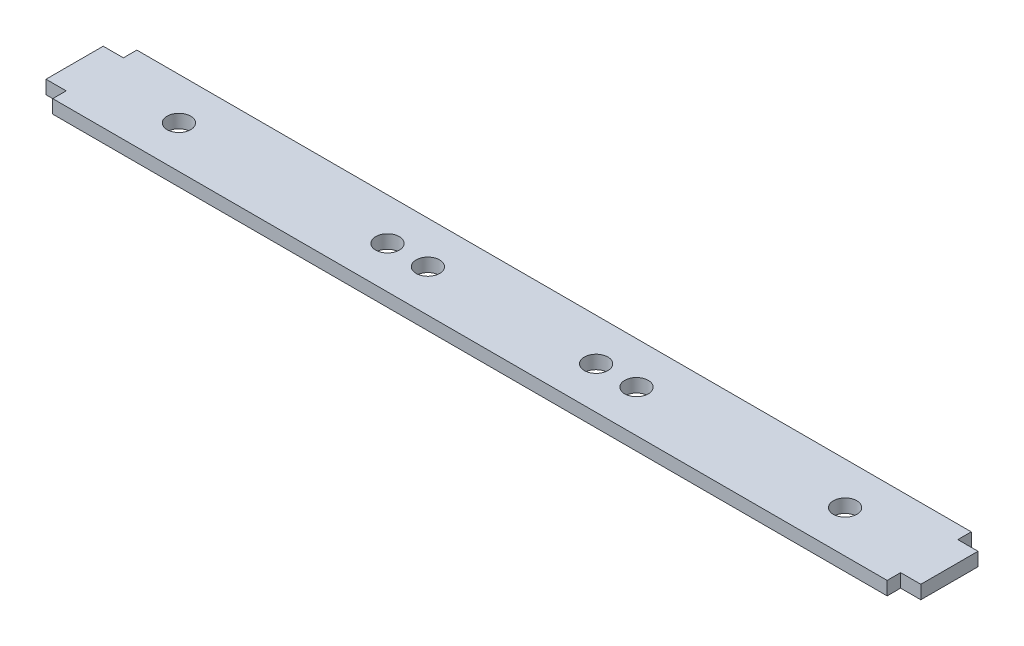
ISO-10303-21;
HEADER;
FILE_DESCRIPTION(('STEP AP214'),'2;1');
FILE_NAME('part.step','',(''),(''),'','','');
FILE_SCHEMA(('AUTOMOTIVE_DESIGN { 1 0 10303 214 1 1 1 1 }'));
ENDSEC;
DATA;
#1=APPLICATION_CONTEXT('core data for automotive mechanical design processes');
#2=APPLICATION_PROTOCOL_DEFINITION('international standard','automotive_design',2000,#1);
#3=PRODUCT_CONTEXT('',#1,'mechanical');
#4=PRODUCT('Part','Part','',(#3));
#5=PRODUCT_RELATED_PRODUCT_CATEGORY('part','',(#4));
#6=PRODUCT_DEFINITION_FORMATION('','',#4);
#7=PRODUCT_DEFINITION_CONTEXT('part definition',#1,'design');
#8=PRODUCT_DEFINITION('design','',#6,#7);
#9=PRODUCT_DEFINITION_SHAPE('','',#8);
#10=(LENGTH_UNIT() NAMED_UNIT(*) SI_UNIT(.MILLI.,.METRE.));
#11=(NAMED_UNIT(*) PLANE_ANGLE_UNIT() SI_UNIT($,.RADIAN.));
#12=(NAMED_UNIT(*) SI_UNIT($,.STERADIAN.) SOLID_ANGLE_UNIT());
#13=UNCERTAINTY_MEASURE_WITH_UNIT(LENGTH_MEASURE(1.E-05),#10,'distance_accuracy_value','');
#14=(GEOMETRIC_REPRESENTATION_CONTEXT(3) GLOBAL_UNCERTAINTY_ASSIGNED_CONTEXT((#13)) GLOBAL_UNIT_ASSIGNED_CONTEXT((#10,
#11,#12)) REPRESENTATION_CONTEXT('',''));
#15=CARTESIAN_POINT('',(0.,0.,0.));
#16=DIRECTION('',(0.,0.,1.));
#17=DIRECTION('',(1.,0.,0.));
#18=AXIS2_PLACEMENT_3D('',#15,#16,#17);
#19=CARTESIAN_POINT('',(0.,-1.,0.));
#20=DIRECTION('',(0.,1.,0.));
#21=DIRECTION('',(0.,0.,1.));
#22=AXIS2_PLACEMENT_3D('',#19,#20,#21);
#23=PLANE('',#22);
#24=CARTESIAN_POINT('',(-18.5,-1.,0.));
#25=DIRECTION('',(0.,-1.,0.));
#26=DIRECTION('',(0.,0.,-1.));
#27=AXIS2_PLACEMENT_3D('',#24,#25,#26);
#28=CIRCLE('',#27,1.75);
#29=CARTESIAN_POINT('',(-18.5,-1.,-1.75));
#30=VERTEX_POINT('',#29);
#31=EDGE_CURVE('E146',#30,#30,#28,.F.);
#32=ORIENTED_EDGE('',*,*,#31,.T.);
#33=EDGE_LOOP('',(#32));
#34=FACE_BOUND('',#33,.T.);
#35=CARTESIAN_POINT('',(18.5,-1.,0.));
#36=DIRECTION('',(0.,-1.,0.));
#37=DIRECTION('',(0.,0.,-1.));
#38=AXIS2_PLACEMENT_3D('',#35,#36,#37);
#39=CIRCLE('',#38,1.75);
#40=CARTESIAN_POINT('',(18.5,-1.,-1.75));
#41=VERTEX_POINT('',#40);
#42=EDGE_CURVE('E150',#41,#41,#39,.F.);
#43=ORIENTED_EDGE('',*,*,#42,.T.);
#44=EDGE_LOOP('',(#43));
#45=FACE_BOUND('',#44,.T.);
#46=CARTESIAN_POINT('',(-49.5,-1.,0.));
#47=DIRECTION('',(0.,-1.,0.));
#48=DIRECTION('',(0.,0.,-1.));
#49=AXIS2_PLACEMENT_3D('',#46,#47,#48);
#50=CIRCLE('',#49,1.75);
#51=CARTESIAN_POINT('',(-49.5,-1.,-1.75000000000001));
#52=VERTEX_POINT('',#51);
#53=EDGE_CURVE('E153',#52,#52,#50,.F.);
#54=ORIENTED_EDGE('',*,*,#53,.T.);
#55=EDGE_LOOP('',(#54));
#56=FACE_BOUND('',#55,.T.);
#57=CARTESIAN_POINT('',(49.5,-1.,0.));
#58=DIRECTION('',(0.,-1.,0.));
#59=DIRECTION('',(0.,0.,-1.));
#60=AXIS2_PLACEMENT_3D('',#57,#58,#59);
#61=CIRCLE('',#60,1.75);
#62=CARTESIAN_POINT('',(49.5,-1.,-1.75000000000001));
#63=VERTEX_POINT('',#62);
#64=EDGE_CURVE('E156',#63,#63,#61,.F.);
#65=ORIENTED_EDGE('',*,*,#64,.T.);
#66=EDGE_LOOP('',(#65));
#67=FACE_BOUND('',#66,.T.);
#68=CARTESIAN_POINT('',(12.5,-1.,0.));
#69=DIRECTION('',(0.,-1.,0.));
#70=DIRECTION('',(0.,0.,-1.));
#71=AXIS2_PLACEMENT_3D('',#68,#69,#70);
#72=CIRCLE('',#71,1.75);
#73=CARTESIAN_POINT('',(12.5,-1.,-1.75));
#74=VERTEX_POINT('',#73);
#75=EDGE_CURVE('E158',#74,#74,#72,.F.);
#76=ORIENTED_EDGE('',*,*,#75,.T.);
#77=EDGE_LOOP('',(#76));
#78=FACE_BOUND('',#77,.T.);
#79=CARTESIAN_POINT('',(-12.5,-1.,0.));
#80=DIRECTION('',(0.,-1.,0.));
#81=DIRECTION('',(0.,0.,-1.));
#82=AXIS2_PLACEMENT_3D('',#79,#80,#81);
#83=CIRCLE('',#82,1.75);
#84=CARTESIAN_POINT('',(-12.5,-1.,-1.75));
#85=VERTEX_POINT('',#84);
#86=EDGE_CURVE('E20',#85,#85,#83,.F.);
#87=ORIENTED_EDGE('',*,*,#86,.T.);
#88=EDGE_LOOP('',(#87));
#89=FACE_BOUND('',#88,.T.);
#90=DIRECTION('',(-1.,0.,0.));
#91=VECTOR('',#90,1.);
#92=CARTESIAN_POINT('',(0.,-1.,4.24999999999998));
#93=LINE('',#92,#91);
#94=CARTESIAN_POINT('',(65.,-1.,4.25));
#95=VERTEX_POINT('',#94);
#96=CARTESIAN_POINT('',(62.,-1.,4.25));
#97=VERTEX_POINT('',#96);
#98=EDGE_CURVE('E163',#95,#97,#93,.T.);
#99=ORIENTED_EDGE('',*,*,#98,.T.);
#100=DIRECTION('',(0.,0.,-1.));
#101=VECTOR('',#100,1.);
#102=CARTESIAN_POINT('',(62.,-1.,0.));
#103=LINE('',#102,#101);
#104=CARTESIAN_POINT('',(62.,-1.,6.25000000000001));
#105=VERTEX_POINT('',#104);
#106=EDGE_CURVE('E175',#105,#97,#103,.T.);
#107=ORIENTED_EDGE('',*,*,#106,.F.);
#108=DIRECTION('',(-1.,0.,0.));
#109=VECTOR('',#108,1.);
#110=CARTESIAN_POINT('',(0.,-1.,6.25000000000001));
#111=LINE('',#110,#109);
#112=CARTESIAN_POINT('',(-62.,-1.,6.25000000000002));
#113=VERTEX_POINT('',#112);
#114=EDGE_CURVE('E177',#105,#113,#111,.T.);
#115=ORIENTED_EDGE('',*,*,#114,.T.);
#116=DIRECTION('',(0.,0.,-1.));
#117=VECTOR('',#116,1.);
#118=CARTESIAN_POINT('',(-62.,-1.,0.));
#119=LINE('',#118,#117);
#120=CARTESIAN_POINT('',(-62.,-1.,4.25000000000001));
#121=VERTEX_POINT('',#120);
#122=EDGE_CURVE('E182',#113,#121,#119,.T.);
#123=ORIENTED_EDGE('',*,*,#122,.T.);
#124=DIRECTION('',(1.,0.,0.));
#125=VECTOR('',#124,1.);
#126=CARTESIAN_POINT('',(0.,-1.,4.25000000000014));
#127=LINE('',#126,#125);
#128=CARTESIAN_POINT('',(-65.,-1.,4.25000000000001));
#129=VERTEX_POINT('',#128);
#130=EDGE_CURVE('E190',#129,#121,#127,.T.);
#131=ORIENTED_EDGE('',*,*,#130,.F.);
#132=DIRECTION('',(0.,0.,-1.));
#133=VECTOR('',#132,1.);
#134=CARTESIAN_POINT('',(-65.,-1.,0.));
#135=LINE('',#134,#133);
#136=CARTESIAN_POINT('',(-65.,-1.,-4.25000000000001));
#137=VERTEX_POINT('',#136);
#138=EDGE_CURVE('E192',#129,#137,#135,.T.);
#139=ORIENTED_EDGE('',*,*,#138,.T.);
#140=DIRECTION('',(1.,0.,0.));
#141=VECTOR('',#140,1.);
#142=CARTESIAN_POINT('',(0.,-1.,-4.25000000000014));
#143=LINE('',#142,#141);
#144=CARTESIAN_POINT('',(-62.,-1.,-4.25000000000002));
#145=VERTEX_POINT('',#144);
#146=EDGE_CURVE('E197',#137,#145,#143,.T.);
#147=ORIENTED_EDGE('',*,*,#146,.T.);
#148=DIRECTION('',(0.,0.,-1.));
#149=VECTOR('',#148,1.);
#150=CARTESIAN_POINT('',(-62.,-1.,0.));
#151=LINE('',#150,#149);
#152=CARTESIAN_POINT('',(-62.,-1.,-6.24999999999998));
#153=VERTEX_POINT('',#152);
#154=EDGE_CURVE('E202',#145,#153,#151,.T.);
#155=ORIENTED_EDGE('',*,*,#154,.T.);
#156=DIRECTION('',(-1.,0.,0.));
#157=VECTOR('',#156,1.);
#158=CARTESIAN_POINT('',(0.,-1.,-6.24999999999999));
#159=LINE('',#158,#157);
#160=CARTESIAN_POINT('',(62.,-1.,-6.25));
#161=VERTEX_POINT('',#160);
#162=EDGE_CURVE('E210',#161,#153,#159,.T.);
#163=ORIENTED_EDGE('',*,*,#162,.F.);
#164=DIRECTION('',(0.,0.,-1.));
#165=VECTOR('',#164,1.);
#166=CARTESIAN_POINT('',(62.,-1.,0.));
#167=LINE('',#166,#165);
#168=CARTESIAN_POINT('',(62.,-1.,-4.25));
#169=VERTEX_POINT('',#168);
#170=EDGE_CURVE('E103',#169,#161,#167,.T.);
#171=ORIENTED_EDGE('',*,*,#170,.F.);
#172=DIRECTION('',(-1.,0.,0.));
#173=VECTOR('',#172,1.);
#174=CARTESIAN_POINT('',(0.,-1.,-4.24999999999998));
#175=LINE('',#174,#173);
#176=CARTESIAN_POINT('',(65.,-1.,-4.25));
#177=VERTEX_POINT('',#176);
#178=EDGE_CURVE('E105',#177,#169,#175,.T.);
#179=ORIENTED_EDGE('',*,*,#178,.F.);
#180=DIRECTION('',(0.,0.,-1.));
#181=VECTOR('',#180,1.);
#182=CARTESIAN_POINT('',(65.,-1.,0.));
#183=LINE('',#182,#181);
#184=EDGE_CURVE('E108',#95,#177,#183,.T.);
#185=ORIENTED_EDGE('',*,*,#184,.F.);
#186=EDGE_LOOP('',(#99,#107,#115,#123,#131,#139,#147,#155,#163,#171,#179,#185));
#187=FACE_BOUND('',#186,.T.);
#188=ADVANCED_FACE('F17',(#34,#45,#56,#67,#78,#89,#187),#23,.F.);
#189=CARTESIAN_POINT('',(65.,1.,0.));
#190=DIRECTION('',(1.,0.,0.));
#191=DIRECTION('',(0.,0.,-1.));
#192=AXIS2_PLACEMENT_3D('',#189,#190,#191);
#193=PLANE('',#192);
#194=DIRECTION('',(0.,0.,1.));
#195=VECTOR('',#194,1.);
#196=CARTESIAN_POINT('',(65.,1.,0.));
#197=LINE('',#196,#195);
#198=CARTESIAN_POINT('',(65.,1.,4.25));
#199=VERTEX_POINT('',#198);
#200=CARTESIAN_POINT('',(65.,1.,-4.25));
#201=VERTEX_POINT('',#200);
#202=EDGE_CURVE('E149',#199,#201,#197,.F.);
#203=ORIENTED_EDGE('',*,*,#202,.F.);
#204=DIRECTION('',(0.,1.,0.));
#205=VECTOR('',#204,1.);
#206=CARTESIAN_POINT('',(65.,1.,4.25));
#207=LINE('',#206,#205);
#208=EDGE_CURVE('E119',#199,#95,#207,.F.);
#209=ORIENTED_EDGE('',*,*,#208,.T.);
#210=ORIENTED_EDGE('',*,*,#184,.T.);
#211=DIRECTION('',(0.,1.,0.));
#212=VECTOR('',#211,1.);
#213=CARTESIAN_POINT('',(65.,1.,-4.25));
#214=LINE('',#213,#212);
#215=EDGE_CURVE('E113',#201,#177,#214,.F.);
#216=ORIENTED_EDGE('',*,*,#215,.F.);
#217=EDGE_LOOP('',(#203,#209,#210,#216));
#218=FACE_BOUND('',#217,.T.);
#219=ADVANCED_FACE('F116',(#218),#193,.T.);
#220=CARTESIAN_POINT('',(0.,1.,-4.24999999999998));
#221=DIRECTION('',(0.,0.,-1.));
#222=DIRECTION('',(-1.,0.,0.));
#223=AXIS2_PLACEMENT_3D('',#220,#221,#222);
#224=PLANE('',#223);
#225=DIRECTION('',(1.,0.,0.));
#226=VECTOR('',#225,1.);
#227=CARTESIAN_POINT('',(0.,1.,-4.25));
#228=LINE('',#227,#226);
#229=CARTESIAN_POINT('',(62.,1.,-4.25));
#230=VERTEX_POINT('',#229);
#231=EDGE_CURVE('E124',#201,#230,#228,.F.);
#232=ORIENTED_EDGE('',*,*,#231,.F.);
#233=ORIENTED_EDGE('',*,*,#215,.T.);
#234=ORIENTED_EDGE('',*,*,#178,.T.);
#235=DIRECTION('',(0.,1.,0.));
#236=VECTOR('',#235,1.);
#237=CARTESIAN_POINT('',(62.,1.,-4.25));
#238=LINE('',#237,#236);
#239=EDGE_CURVE('E127',#230,#169,#238,.F.);
#240=ORIENTED_EDGE('',*,*,#239,.F.);
#241=EDGE_LOOP('',(#232,#233,#234,#240));
#242=FACE_BOUND('',#241,.T.);
#243=ADVANCED_FACE('F122',(#242),#224,.T.);
#244=CARTESIAN_POINT('',(62.,1.,0.));
#245=DIRECTION('',(1.,0.,0.));
#246=DIRECTION('',(0.,0.,-1.));
#247=AXIS2_PLACEMENT_3D('',#244,#245,#246);
#248=PLANE('',#247);
#249=DIRECTION('',(0.,0.,1.));
#250=VECTOR('',#249,1.);
#251=CARTESIAN_POINT('',(62.,1.,0.));
#252=LINE('',#251,#250);
#253=CARTESIAN_POINT('',(62.,1.,-6.25));
#254=VERTEX_POINT('',#253);
#255=EDGE_CURVE('E215',#230,#254,#252,.F.);
#256=ORIENTED_EDGE('',*,*,#255,.F.);
#257=ORIENTED_EDGE('',*,*,#239,.T.);
#258=ORIENTED_EDGE('',*,*,#170,.T.);
#259=DIRECTION('',(0.,1.,0.));
#260=VECTOR('',#259,1.);
#261=CARTESIAN_POINT('',(62.,1.,-6.24999999999999));
#262=LINE('',#261,#260);
#263=EDGE_CURVE('E207',#254,#161,#262,.F.);
#264=ORIENTED_EDGE('',*,*,#263,.F.);
#265=EDGE_LOOP('',(#256,#257,#258,#264));
#266=FACE_BOUND('',#265,.T.);
#267=ADVANCED_FACE('F213',(#266),#248,.T.);
#268=CARTESIAN_POINT('',(0.,1.,-6.24999999999999));
#269=DIRECTION('',(0.,0.,-1.));
#270=DIRECTION('',(-1.,0.,0.));
#271=AXIS2_PLACEMENT_3D('',#268,#269,#270);
#272=PLANE('',#271);
#273=DIRECTION('',(1.,0.,0.));
#274=VECTOR('',#273,1.);
#275=CARTESIAN_POINT('',(0.,1.,-6.25));
#276=LINE('',#275,#274);
#277=CARTESIAN_POINT('',(-62.,1.,-6.24999999999998));
#278=VERTEX_POINT('',#277);
#279=EDGE_CURVE('E219',#254,#278,#276,.F.);
#280=ORIENTED_EDGE('',*,*,#279,.F.);
#281=ORIENTED_EDGE('',*,*,#263,.T.);
#282=ORIENTED_EDGE('',*,*,#162,.T.);
#283=DIRECTION('',(0.,1.,0.));
#284=VECTOR('',#283,1.);
#285=CARTESIAN_POINT('',(-62.,1.,-6.24999999999998));
#286=LINE('',#285,#284);
#287=EDGE_CURVE('E205',#153,#278,#286,.T.);
#288=ORIENTED_EDGE('',*,*,#287,.T.);
#289=EDGE_LOOP('',(#280,#281,#282,#288));
#290=FACE_BOUND('',#289,.T.);
#291=ADVANCED_FACE('F400',(#290),#272,.T.);
#292=CARTESIAN_POINT('',(-62.,1.,0.));
#293=DIRECTION('',(1.,0.,0.));
#294=DIRECTION('',(0.,0.,-1.));
#295=AXIS2_PLACEMENT_3D('',#292,#293,#294);
#296=PLANE('',#295);
#297=DIRECTION('',(0.,1.,0.));
#298=VECTOR('',#297,1.);
#299=CARTESIAN_POINT('',(-62.,1.,-4.25000000000002));
#300=LINE('',#299,#298);
#301=CARTESIAN_POINT('',(-62.,1.,-4.25000000000002));
#302=VERTEX_POINT('',#301);
#303=EDGE_CURVE('E200',#145,#302,#300,.T.);
#304=ORIENTED_EDGE('',*,*,#303,.T.);
#305=DIRECTION('',(0.,0.,1.));
#306=VECTOR('',#305,1.);
#307=CARTESIAN_POINT('',(-62.,1.,0.));
#308=LINE('',#307,#306);
#309=EDGE_CURVE('E226',#278,#302,#308,.T.);
#310=ORIENTED_EDGE('',*,*,#309,.F.);
#311=ORIENTED_EDGE('',*,*,#287,.F.);
#312=ORIENTED_EDGE('',*,*,#154,.F.);
#313=EDGE_LOOP('',(#304,#310,#311,#312));
#314=FACE_BOUND('',#313,.T.);
#315=ADVANCED_FACE('F391',(#314),#296,.F.);
#316=CARTESIAN_POINT('',(0.,1.,-4.25000000000014));
#317=DIRECTION('',(0.,0.,1.));
#318=DIRECTION('',(1.,0.,0.));
#319=AXIS2_PLACEMENT_3D('',#316,#317,#318);
#320=PLANE('',#319);
#321=DIRECTION('',(0.,1.,0.));
#322=VECTOR('',#321,1.);
#323=CARTESIAN_POINT('',(-65.,1.,-4.25000000000001));
#324=LINE('',#323,#322);
#325=CARTESIAN_POINT('',(-65.,1.,-4.25000000000001));
#326=VERTEX_POINT('',#325);
#327=EDGE_CURVE('E195',#137,#326,#324,.T.);
#328=ORIENTED_EDGE('',*,*,#327,.T.);
#329=DIRECTION('',(1.,0.,0.));
#330=VECTOR('',#329,1.);
#331=CARTESIAN_POINT('',(0.,1.,-4.25000000000002));
#332=LINE('',#331,#330);
#333=EDGE_CURVE('E229',#302,#326,#332,.F.);
#334=ORIENTED_EDGE('',*,*,#333,.F.);
#335=ORIENTED_EDGE('',*,*,#303,.F.);
#336=ORIENTED_EDGE('',*,*,#146,.F.);
#337=EDGE_LOOP('',(#328,#334,#335,#336));
#338=FACE_BOUND('',#337,.T.);
#339=ADVANCED_FACE('F382',(#338),#320,.F.);
#340=CARTESIAN_POINT('',(-65.,1.,0.));
#341=DIRECTION('',(1.,0.,0.));
#342=DIRECTION('',(0.,0.,-1.));
#343=AXIS2_PLACEMENT_3D('',#340,#341,#342);
#344=PLANE('',#343);
#345=DIRECTION('',(0.,1.,0.));
#346=VECTOR('',#345,1.);
#347=CARTESIAN_POINT('',(-65.,1.,4.25000000000001));
#348=LINE('',#347,#346);
#349=CARTESIAN_POINT('',(-65.,1.,4.25000000000001));
#350=VERTEX_POINT('',#349);
#351=EDGE_CURVE('E187',#350,#129,#348,.F.);
#352=ORIENTED_EDGE('',*,*,#351,.F.);
#353=DIRECTION('',(0.,0.,1.));
#354=VECTOR('',#353,1.);
#355=CARTESIAN_POINT('',(-65.,1.,0.));
#356=LINE('',#355,#354);
#357=EDGE_CURVE('E232',#326,#350,#356,.T.);
#358=ORIENTED_EDGE('',*,*,#357,.F.);
#359=ORIENTED_EDGE('',*,*,#327,.F.);
#360=ORIENTED_EDGE('',*,*,#138,.F.);
#361=EDGE_LOOP('',(#352,#358,#359,#360));
#362=FACE_BOUND('',#361,.T.);
#363=ADVANCED_FACE('F373',(#362),#344,.F.);
#364=CARTESIAN_POINT('',(0.,1.,4.25000000000014));
#365=DIRECTION('',(0.,0.,1.));
#366=DIRECTION('',(1.,0.,0.));
#367=AXIS2_PLACEMENT_3D('',#364,#365,#366);
#368=PLANE('',#367);
#369=DIRECTION('',(1.,0.,0.));
#370=VECTOR('',#369,1.);
#371=CARTESIAN_POINT('',(0.,1.,4.25000000000001));
#372=LINE('',#371,#370);
#373=CARTESIAN_POINT('',(-62.,1.,4.25000000000001));
#374=VERTEX_POINT('',#373);
#375=EDGE_CURVE('E235',#350,#374,#372,.T.);
#376=ORIENTED_EDGE('',*,*,#375,.F.);
#377=ORIENTED_EDGE('',*,*,#351,.T.);
#378=ORIENTED_EDGE('',*,*,#130,.T.);
#379=DIRECTION('',(0.,1.,0.));
#380=VECTOR('',#379,1.);
#381=CARTESIAN_POINT('',(-62.,1.,4.25000000000001));
#382=LINE('',#381,#380);
#383=EDGE_CURVE('E185',#121,#374,#382,.T.);
#384=ORIENTED_EDGE('',*,*,#383,.T.);
#385=EDGE_LOOP('',(#376,#377,#378,#384));
#386=FACE_BOUND('',#385,.T.);
#387=ADVANCED_FACE('F364',(#386),#368,.T.);
#388=CARTESIAN_POINT('',(-62.,1.,0.));
#389=DIRECTION('',(1.,0.,0.));
#390=DIRECTION('',(0.,0.,-1.));
#391=AXIS2_PLACEMENT_3D('',#388,#389,#390);
#392=PLANE('',#391);
#393=DIRECTION('',(0.,1.,0.));
#394=VECTOR('',#393,1.);
#395=CARTESIAN_POINT('',(-62.,1.,6.25000000000002));
#396=LINE('',#395,#394);
#397=CARTESIAN_POINT('',(-62.,1.,6.25000000000002));
#398=VERTEX_POINT('',#397);
#399=EDGE_CURVE('E180',#113,#398,#396,.T.);
#400=ORIENTED_EDGE('',*,*,#399,.T.);
#401=DIRECTION('',(0.,0.,1.));
#402=VECTOR('',#401,1.);
#403=CARTESIAN_POINT('',(-62.,1.,0.));
#404=LINE('',#403,#402);
#405=EDGE_CURVE('E238',#374,#398,#404,.T.);
#406=ORIENTED_EDGE('',*,*,#405,.F.);
#407=ORIENTED_EDGE('',*,*,#383,.F.);
#408=ORIENTED_EDGE('',*,*,#122,.F.);
#409=EDGE_LOOP('',(#400,#406,#407,#408));
#410=FACE_BOUND('',#409,.T.);
#411=ADVANCED_FACE('F355',(#410),#392,.F.);
#412=CARTESIAN_POINT('',(0.,1.,6.25000000000001));
#413=DIRECTION('',(0.,0.,-1.));
#414=DIRECTION('',(-1.,0.,0.));
#415=AXIS2_PLACEMENT_3D('',#412,#413,#414);
#416=PLANE('',#415);
#417=DIRECTION('',(0.,1.,0.));
#418=VECTOR('',#417,1.);
#419=CARTESIAN_POINT('',(62.,1.,6.25000000000001));
#420=LINE('',#419,#418);
#421=CARTESIAN_POINT('',(62.,1.,6.25000000000001));
#422=VERTEX_POINT('',#421);
#423=EDGE_CURVE('E172',#422,#105,#420,.F.);
#424=ORIENTED_EDGE('',*,*,#423,.F.);
#425=DIRECTION('',(1.,0.,0.));
#426=VECTOR('',#425,1.);
#427=CARTESIAN_POINT('',(0.,1.,6.25000000000002));
#428=LINE('',#427,#426);
#429=EDGE_CURVE('E241',#398,#422,#428,.T.);
#430=ORIENTED_EDGE('',*,*,#429,.F.);
#431=ORIENTED_EDGE('',*,*,#399,.F.);
#432=ORIENTED_EDGE('',*,*,#114,.F.);
#433=EDGE_LOOP('',(#424,#430,#431,#432));
#434=FACE_BOUND('',#433,.T.);
#435=ADVANCED_FACE('F260',(#434),#416,.F.);
#436=CARTESIAN_POINT('',(62.,1.,0.));
#437=DIRECTION('',(1.,0.,0.));
#438=DIRECTION('',(0.,0.,-1.));
#439=AXIS2_PLACEMENT_3D('',#436,#437,#438);
#440=PLANE('',#439);
#441=DIRECTION('',(0.,0.,1.));
#442=VECTOR('',#441,1.);
#443=CARTESIAN_POINT('',(62.,1.,0.));
#444=LINE('',#443,#442);
#445=CARTESIAN_POINT('',(62.,1.,4.25));
#446=VERTEX_POINT('',#445);
#447=EDGE_CURVE('E244',#422,#446,#444,.F.);
#448=ORIENTED_EDGE('',*,*,#447,.F.);
#449=ORIENTED_EDGE('',*,*,#423,.T.);
#450=ORIENTED_EDGE('',*,*,#106,.T.);
#451=DIRECTION('',(0.,1.,0.));
#452=VECTOR('',#451,1.);
#453=CARTESIAN_POINT('',(62.,1.,4.25));
#454=LINE('',#453,#452);
#455=EDGE_CURVE('E35',#97,#446,#454,.T.);
#456=ORIENTED_EDGE('',*,*,#455,.T.);
#457=EDGE_LOOP('',(#448,#449,#450,#456));
#458=FACE_BOUND('',#457,.T.);
#459=ADVANCED_FACE('F250',(#458),#440,.T.);
#460=CARTESIAN_POINT('',(0.,1.,4.24999999999998));
#461=DIRECTION('',(0.,0.,-1.));
#462=DIRECTION('',(-1.,0.,0.));
#463=AXIS2_PLACEMENT_3D('',#460,#461,#462);
#464=PLANE('',#463);
#465=ORIENTED_EDGE('',*,*,#208,.F.);
#466=DIRECTION('',(1.,0.,0.));
#467=VECTOR('',#466,1.);
#468=CARTESIAN_POINT('',(0.,1.,4.25));
#469=LINE('',#468,#467);
#470=EDGE_CURVE('E145',#446,#199,#469,.T.);
#471=ORIENTED_EDGE('',*,*,#470,.F.);
#472=ORIENTED_EDGE('',*,*,#455,.F.);
#473=ORIENTED_EDGE('',*,*,#98,.F.);
#474=EDGE_LOOP('',(#465,#471,#472,#473));
#475=FACE_BOUND('',#474,.T.);
#476=ADVANCED_FACE('F247',(#475),#464,.F.);
#477=CARTESIAN_POINT('',(-12.5,1.,0.));
#478=DIRECTION('',(0.,-1.,0.));
#479=DIRECTION('',(0.,0.,-1.));
#480=AXIS2_PLACEMENT_3D('',#477,#478,#479);
#481=CYLINDRICAL_SURFACE('',#480,1.75);
#482=ORIENTED_EDGE('',*,*,#86,.F.);
#483=EDGE_LOOP('',(#482));
#484=FACE_BOUND('',#483,.T.);
#485=CARTESIAN_POINT('',(-12.5,1.,0.));
#486=DIRECTION('',(0.,-1.,0.));
#487=DIRECTION('',(0.,0.,-1.));
#488=AXIS2_PLACEMENT_3D('',#485,#486,#487);
#489=CIRCLE('',#488,1.75);
#490=CARTESIAN_POINT('',(-12.5,1.,-1.75));
#491=VERTEX_POINT('',#490);
#492=EDGE_CURVE('E142',#491,#491,#489,.T.);
#493=ORIENTED_EDGE('',*,*,#492,.F.);
#494=EDGE_LOOP('',(#493));
#495=FACE_BOUND('',#494,.T.);
#496=ADVANCED_FACE('F249',(#484,#495),#481,.F.);
#497=CARTESIAN_POINT('',(12.5,1.,0.));
#498=DIRECTION('',(0.,-1.,0.));
#499=DIRECTION('',(0.,0.,-1.));
#500=AXIS2_PLACEMENT_3D('',#497,#498,#499);
#501=CYLINDRICAL_SURFACE('',#500,1.75);
#502=CARTESIAN_POINT('',(12.5,1.,0.));
#503=DIRECTION('',(0.,-1.,0.));
#504=DIRECTION('',(0.,0.,-1.));
#505=AXIS2_PLACEMENT_3D('',#502,#503,#504);
#506=CIRCLE('',#505,1.75);
#507=CARTESIAN_POINT('',(12.5,1.,-1.75));
#508=VERTEX_POINT('',#507);
#509=EDGE_CURVE('E139',#508,#508,#506,.T.);
#510=ORIENTED_EDGE('',*,*,#509,.F.);
#511=EDGE_LOOP('',(#510));
#512=FACE_BOUND('',#511,.T.);
#513=ORIENTED_EDGE('',*,*,#75,.F.);
#514=EDGE_LOOP('',(#513));
#515=FACE_BOUND('',#514,.T.);
#516=ADVANCED_FACE('F257',(#512,#515),#501,.F.);
#517=CARTESIAN_POINT('',(49.5,1.,0.));
#518=DIRECTION('',(0.,-1.,0.));
#519=DIRECTION('',(0.,0.,-1.));
#520=AXIS2_PLACEMENT_3D('',#517,#518,#519);
#521=CYLINDRICAL_SURFACE('',#520,1.75);
#522=CARTESIAN_POINT('',(49.5,1.,0.));
#523=DIRECTION('',(0.,-1.,0.));
#524=DIRECTION('',(0.,0.,-1.));
#525=AXIS2_PLACEMENT_3D('',#522,#523,#524);
#526=CIRCLE('',#525,1.75);
#527=CARTESIAN_POINT('',(49.5,1.,-1.75000000000001));
#528=VERTEX_POINT('',#527);
#529=EDGE_CURVE('E136',#528,#528,#526,.T.);
#530=ORIENTED_EDGE('',*,*,#529,.F.);
#531=EDGE_LOOP('',(#530));
#532=FACE_BOUND('',#531,.T.);
#533=ORIENTED_EDGE('',*,*,#64,.F.);
#534=EDGE_LOOP('',(#533));
#535=FACE_BOUND('',#534,.T.);
#536=ADVANCED_FACE('F280',(#532,#535),#521,.F.);
#537=CARTESIAN_POINT('',(-49.5,1.,0.));
#538=DIRECTION('',(0.,-1.,0.));
#539=DIRECTION('',(0.,0.,-1.));
#540=AXIS2_PLACEMENT_3D('',#537,#538,#539);
#541=CYLINDRICAL_SURFACE('',#540,1.75);
#542=ORIENTED_EDGE('',*,*,#53,.F.);
#543=EDGE_LOOP('',(#542));
#544=FACE_BOUND('',#543,.T.);
#545=CARTESIAN_POINT('',(-49.5,1.,0.));
#546=DIRECTION('',(0.,-1.,0.));
#547=DIRECTION('',(0.,0.,-1.));
#548=AXIS2_PLACEMENT_3D('',#545,#546,#547);
#549=CIRCLE('',#548,1.75);
#550=CARTESIAN_POINT('',(-49.5,1.,-1.75000000000001));
#551=VERTEX_POINT('',#550);
#552=EDGE_CURVE('E133',#551,#551,#549,.T.);
#553=ORIENTED_EDGE('',*,*,#552,.F.);
#554=EDGE_LOOP('',(#553));
#555=FACE_BOUND('',#554,.T.);
#556=ADVANCED_FACE('F276',(#544,#555),#541,.F.);
#557=CARTESIAN_POINT('',(18.5,1.,0.));
#558=DIRECTION('',(0.,-1.,0.));
#559=DIRECTION('',(0.,0.,-1.));
#560=AXIS2_PLACEMENT_3D('',#557,#558,#559);
#561=CYLINDRICAL_SURFACE('',#560,1.75);
#562=CARTESIAN_POINT('',(18.5,1.,0.));
#563=DIRECTION('',(0.,-1.,0.));
#564=DIRECTION('',(0.,0.,-1.));
#565=AXIS2_PLACEMENT_3D('',#562,#563,#564);
#566=CIRCLE('',#565,1.75);
#567=CARTESIAN_POINT('',(18.5,1.,-1.75));
#568=VERTEX_POINT('',#567);
#569=EDGE_CURVE('E26',#568,#568,#566,.T.);
#570=ORIENTED_EDGE('',*,*,#569,.F.);
#571=EDGE_LOOP('',(#570));
#572=FACE_BOUND('',#571,.T.);
#573=ORIENTED_EDGE('',*,*,#42,.F.);
#574=EDGE_LOOP('',(#573));
#575=FACE_BOUND('',#574,.T.);
#576=ADVANCED_FACE('F269',(#572,#575),#561,.F.);
#577=CARTESIAN_POINT('',(-18.5,1.,0.));
#578=DIRECTION('',(0.,-1.,0.));
#579=DIRECTION('',(0.,0.,-1.));
#580=AXIS2_PLACEMENT_3D('',#577,#578,#579);
#581=CYLINDRICAL_SURFACE('',#580,1.75);
#582=ORIENTED_EDGE('',*,*,#31,.F.);
#583=EDGE_LOOP('',(#582));
#584=FACE_BOUND('',#583,.T.);
#585=CARTESIAN_POINT('',(-18.5,1.,0.));
#586=DIRECTION('',(0.,-1.,0.));
#587=DIRECTION('',(0.,0.,-1.));
#588=AXIS2_PLACEMENT_3D('',#585,#586,#587);
#589=CIRCLE('',#588,1.75);
#590=CARTESIAN_POINT('',(-18.5,1.,-1.75));
#591=VERTEX_POINT('',#590);
#592=EDGE_CURVE('E11',#591,#591,#589,.T.);
#593=ORIENTED_EDGE('',*,*,#592,.F.);
#594=EDGE_LOOP('',(#593));
#595=FACE_BOUND('',#594,.T.);
#596=ADVANCED_FACE('F263',(#584,#595),#581,.F.);
#597=CARTESIAN_POINT('',(0.,1.,0.));
#598=DIRECTION('',(0.,1.,0.));
#599=DIRECTION('',(0.,0.,1.));
#600=AXIS2_PLACEMENT_3D('',#597,#598,#599);
#601=PLANE('',#600);
#602=ORIENTED_EDGE('',*,*,#592,.T.);
#603=EDGE_LOOP('',(#602));
#604=FACE_BOUND('',#603,.T.);
#605=ORIENTED_EDGE('',*,*,#569,.T.);
#606=EDGE_LOOP('',(#605));
#607=FACE_BOUND('',#606,.T.);
#608=ORIENTED_EDGE('',*,*,#552,.T.);
#609=EDGE_LOOP('',(#608));
#610=FACE_BOUND('',#609,.T.);
#611=ORIENTED_EDGE('',*,*,#529,.T.);
#612=EDGE_LOOP('',(#611));
#613=FACE_BOUND('',#612,.T.);
#614=ORIENTED_EDGE('',*,*,#509,.T.);
#615=EDGE_LOOP('',(#614));
#616=FACE_BOUND('',#615,.T.);
#617=ORIENTED_EDGE('',*,*,#492,.T.);
#618=EDGE_LOOP('',(#617));
#619=FACE_BOUND('',#618,.T.);
#620=ORIENTED_EDGE('',*,*,#447,.T.);
#621=ORIENTED_EDGE('',*,*,#470,.T.);
#622=ORIENTED_EDGE('',*,*,#202,.T.);
#623=ORIENTED_EDGE('',*,*,#231,.T.);
#624=ORIENTED_EDGE('',*,*,#255,.T.);
#625=ORIENTED_EDGE('',*,*,#279,.T.);
#626=ORIENTED_EDGE('',*,*,#309,.T.);
#627=ORIENTED_EDGE('',*,*,#333,.T.);
#628=ORIENTED_EDGE('',*,*,#357,.T.);
#629=ORIENTED_EDGE('',*,*,#375,.T.);
#630=ORIENTED_EDGE('',*,*,#405,.T.);
#631=ORIENTED_EDGE('',*,*,#429,.T.);
#632=EDGE_LOOP('',(#620,#621,#622,#623,#624,#625,#626,#627,#628,#629,#630,#631));
#633=FACE_BOUND('',#632,.T.);
#634=ADVANCED_FACE('F222',(#604,#607,#610,#613,#616,#619,#633),#601,.T.);
#635=CLOSED_SHELL('',(#188,#219,#243,#267,#291,#315,#339,#363,#387,#411,#435,#459,#476,#496,
#516,#536,#556,#576,#596,#634));
#636=MANIFOLD_SOLID_BREP('B1',#635);
#637=ADVANCED_BREP_SHAPE_REPRESENTATION('',(#18,#636),#14);
#638=SHAPE_DEFINITION_REPRESENTATION(#9,#637);
ENDSEC;
END-ISO-10303-21;
